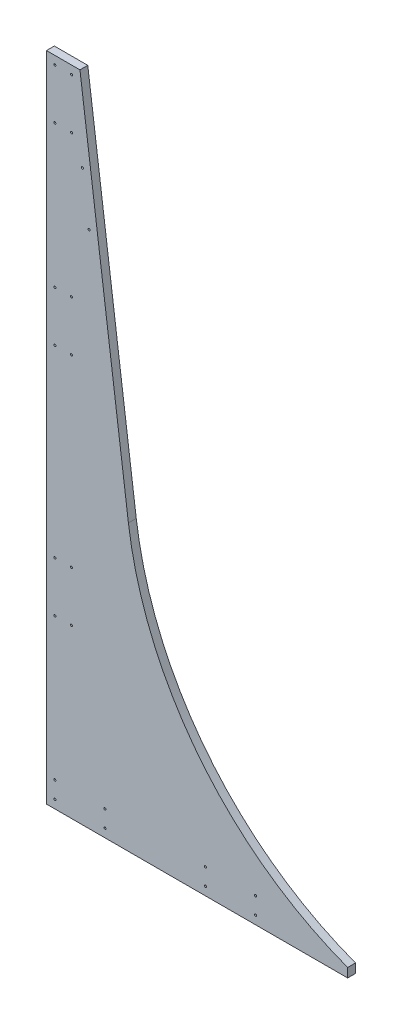
ISO-10303-21;
HEADER;
FILE_DESCRIPTION(('STEP AP214'),'2;1');
FILE_NAME('part.step','',(''),(''),'','','');
FILE_SCHEMA(('AUTOMOTIVE_DESIGN { 1 0 10303 214 1 1 1 1 }'));
ENDSEC;
DATA;
#1=APPLICATION_CONTEXT('core data for automotive mechanical design processes');
#2=APPLICATION_PROTOCOL_DEFINITION('international standard','automotive_design',2000,#1);
#3=PRODUCT_CONTEXT('',#1,'mechanical');
#4=PRODUCT('Part','Part','',(#3));
#5=PRODUCT_RELATED_PRODUCT_CATEGORY('part','',(#4));
#6=PRODUCT_DEFINITION_FORMATION('','',#4);
#7=PRODUCT_DEFINITION_CONTEXT('part definition',#1,'design');
#8=PRODUCT_DEFINITION('design','',#6,#7);
#9=PRODUCT_DEFINITION_SHAPE('','',#8);
#10=(LENGTH_UNIT() NAMED_UNIT(*) SI_UNIT(.MILLI.,.METRE.));
#11=(NAMED_UNIT(*) PLANE_ANGLE_UNIT() SI_UNIT($,.RADIAN.));
#12=(NAMED_UNIT(*) SI_UNIT($,.STERADIAN.) SOLID_ANGLE_UNIT());
#13=UNCERTAINTY_MEASURE_WITH_UNIT(LENGTH_MEASURE(1.E-05),#10,'distance_accuracy_value','');
#14=(GEOMETRIC_REPRESENTATION_CONTEXT(3) GLOBAL_UNCERTAINTY_ASSIGNED_CONTEXT((#13)) GLOBAL_UNIT_ASSIGNED_CONTEXT((#10,
#11,#12)) REPRESENTATION_CONTEXT('',''));
#15=CARTESIAN_POINT('',(0.,0.,0.));
#16=DIRECTION('',(0.,0.,1.));
#17=DIRECTION('',(1.,0.,0.));
#18=AXIS2_PLACEMENT_3D('',#15,#16,#17);
#19=CARTESIAN_POINT('',(638.116559349375,499.436357901165,11.90625));
#20=DIRECTION('',(0.,0.,-1.));
#21=DIRECTION('',(-1.,0.,0.));
#22=AXIS2_PLACEMENT_3D('',#19,#20,#21);
#23=CYLINDRICAL_SURFACE('',#22,518.182264806593);
#24=CARTESIAN_POINT('',(638.116559349375,499.436357901165,0.));
#25=DIRECTION('',(0.,0.,1.));
#26=DIRECTION('',(1.,0.,0.));
#27=AXIS2_PLACEMENT_3D('',#24,#25,#26);
#28=CIRCLE('',#27,518.182264806593);
#29=CARTESIAN_POINT('',(124.367415651835,431.8,0.));
#30=VERTEX_POINT('',#29);
#31=CARTESIAN_POINT('',(457.201,13.8620382080899,0.));
#32=VERTEX_POINT('',#31);
#33=EDGE_CURVE('E144',#30,#32,#28,.T.);
#34=ORIENTED_EDGE('',*,*,#33,.F.);
#35=DIRECTION('',(0.,0.,-1.));
#36=VECTOR('',#35,1.);
#37=CARTESIAN_POINT('',(124.367415651835,431.8,11.90625));
#38=LINE('',#37,#36);
#39=CARTESIAN_POINT('',(124.367415651835,431.8,11.90625));
#40=VERTEX_POINT('',#39);
#41=EDGE_CURVE('E13',#40,#30,#38,.T.);
#42=ORIENTED_EDGE('',*,*,#41,.F.);
#43=CARTESIAN_POINT('',(638.116559349375,499.436357901165,11.90625));
#44=DIRECTION('',(0.,0.,1.));
#45=DIRECTION('',(1.,0.,0.));
#46=AXIS2_PLACEMENT_3D('',#43,#44,#45);
#47=CIRCLE('',#46,518.182264806593);
#48=CARTESIAN_POINT('',(457.201,13.8620382080899,11.90625));
#49=VERTEX_POINT('',#48);
#50=EDGE_CURVE('E165',#40,#49,#47,.T.);
#51=ORIENTED_EDGE('',*,*,#50,.T.);
#52=DIRECTION('',(0.,0.,-1.));
#53=VECTOR('',#52,1.);
#54=CARTESIAN_POINT('',(457.201,13.8620382080899,11.90625));
#55=LINE('',#54,#53);
#56=EDGE_CURVE('E72',#49,#32,#55,.T.);
#57=ORIENTED_EDGE('',*,*,#56,.T.);
#58=EDGE_LOOP('',(#34,#42,#51,#57));
#59=FACE_BOUND('',#58,.T.);
#60=ADVANCED_FACE('F55',(#59),#23,.F.);
#61=CARTESIAN_POINT('',(178.127589027018,23.4509419846275,11.90625));
#62=DIRECTION('',(0.991444861373811,0.130526192220048,0.));
#63=DIRECTION('',(-0.130526192220048,0.991444861373811,0.));
#64=AXIS2_PLACEMENT_3D('',#61,#62,#63);
#65=PLANE('',#64);
#66=DIRECTION('',(0.130526192220048,-0.991444861373811,0.));
#67=VECTOR('',#66,1.);
#68=CARTESIAN_POINT('',(178.127589027018,23.4509419846275,0.));
#69=LINE('',#68,#67);
#70=CARTESIAN_POINT('',(50.8,990.6,0.));
#71=VERTEX_POINT('',#70);
#72=EDGE_CURVE('E147',#71,#30,#69,.T.);
#73=ORIENTED_EDGE('',*,*,#72,.F.);
#74=DIRECTION('',(0.,0.,-1.));
#75=VECTOR('',#74,1.);
#76=CARTESIAN_POINT('',(50.8,990.6,11.90625));
#77=LINE('',#76,#75);
#78=CARTESIAN_POINT('',(50.8,990.6,11.90625));
#79=VERTEX_POINT('',#78);
#80=EDGE_CURVE('E64',#79,#71,#77,.T.);
#81=ORIENTED_EDGE('',*,*,#80,.F.);
#82=DIRECTION('',(0.130526192220048,-0.991444861373811,0.));
#83=VECTOR('',#82,1.);
#84=CARTESIAN_POINT('',(178.127589027018,23.4509419846275,11.90625));
#85=LINE('',#84,#83);
#86=EDGE_CURVE('E138',#79,#40,#85,.T.);
#87=ORIENTED_EDGE('',*,*,#86,.T.);
#88=ORIENTED_EDGE('',*,*,#41,.T.);
#89=EDGE_LOOP('',(#73,#81,#87,#88));
#90=FACE_BOUND('',#89,.T.);
#91=ADVANCED_FACE('F178',(#90),#65,.T.);
#92=CARTESIAN_POINT('',(0.,990.6,11.90625));
#93=DIRECTION('',(0.,1.,0.));
#94=DIRECTION('',(0.,0.,1.));
#95=AXIS2_PLACEMENT_3D('',#92,#93,#94);
#96=PLANE('',#95);
#97=DIRECTION('',(1.,0.,0.));
#98=VECTOR('',#97,1.);
#99=CARTESIAN_POINT('',(0.,990.6,0.));
#100=LINE('',#99,#98);
#101=CARTESIAN_POINT('',(0.,990.6,0.));
#102=VERTEX_POINT('',#101);
#103=EDGE_CURVE('E152',#102,#71,#100,.T.);
#104=ORIENTED_EDGE('',*,*,#103,.F.);
#105=DIRECTION('',(0.,0.,-1.));
#106=VECTOR('',#105,1.);
#107=CARTESIAN_POINT('',(0.,990.6,11.90625));
#108=LINE('',#107,#106);
#109=CARTESIAN_POINT('',(0.,990.6,11.90625));
#110=VERTEX_POINT('',#109);
#111=EDGE_CURVE('E121',#110,#102,#108,.T.);
#112=ORIENTED_EDGE('',*,*,#111,.F.);
#113=DIRECTION('',(1.,0.,0.));
#114=VECTOR('',#113,1.);
#115=CARTESIAN_POINT('',(0.,990.6,11.90625));
#116=LINE('',#115,#114);
#117=EDGE_CURVE('E134',#110,#79,#116,.T.);
#118=ORIENTED_EDGE('',*,*,#117,.T.);
#119=ORIENTED_EDGE('',*,*,#80,.T.);
#120=EDGE_LOOP('',(#104,#112,#118,#119));
#121=FACE_BOUND('',#120,.T.);
#122=ADVANCED_FACE('F175',(#121),#96,.T.);
#123=CARTESIAN_POINT('',(0.,0.,11.90625));
#124=DIRECTION('',(-1.,0.,0.));
#125=DIRECTION('',(0.,0.,1.));
#126=AXIS2_PLACEMENT_3D('',#123,#124,#125);
#127=PLANE('',#126);
#128=DIRECTION('',(0.,1.,0.));
#129=VECTOR('',#128,1.);
#130=CARTESIAN_POINT('',(0.,0.,0.));
#131=LINE('',#130,#129);
#132=CARTESIAN_POINT('',(0.,0.,0.));
#133=VERTEX_POINT('',#132);
#134=EDGE_CURVE('E117',#133,#102,#131,.T.);
#135=ORIENTED_EDGE('',*,*,#134,.F.);
#136=DIRECTION('',(0.,0.,-1.));
#137=VECTOR('',#136,1.);
#138=CARTESIAN_POINT('',(0.,0.,11.90625));
#139=LINE('',#138,#137);
#140=CARTESIAN_POINT('',(0.,0.,11.90625));
#141=VERTEX_POINT('',#140);
#142=EDGE_CURVE('E111',#141,#133,#139,.T.);
#143=ORIENTED_EDGE('',*,*,#142,.F.);
#144=DIRECTION('',(0.,1.,0.));
#145=VECTOR('',#144,1.);
#146=CARTESIAN_POINT('',(0.,0.,11.90625));
#147=LINE('',#146,#145);
#148=EDGE_CURVE('E115',#141,#110,#147,.T.);
#149=ORIENTED_EDGE('',*,*,#148,.T.);
#150=ORIENTED_EDGE('',*,*,#111,.T.);
#151=EDGE_LOOP('',(#135,#143,#149,#150));
#152=FACE_BOUND('',#151,.T.);
#153=ADVANCED_FACE('F113',(#152),#127,.T.);
#154=CARTESIAN_POINT('',(0.,0.,11.90625));
#155=DIRECTION('',(0.,1.,0.));
#156=DIRECTION('',(0.,0.,1.));
#157=AXIS2_PLACEMENT_3D('',#154,#155,#156);
#158=PLANE('',#157);
#159=DIRECTION('',(1.,0.,0.));
#160=VECTOR('',#159,1.);
#161=CARTESIAN_POINT('',(0.,0.,0.));
#162=LINE('',#161,#160);
#163=CARTESIAN_POINT('',(457.201,0.,0.));
#164=VERTEX_POINT('',#163);
#165=EDGE_CURVE('E158',#133,#164,#162,.T.);
#166=ORIENTED_EDGE('',*,*,#165,.T.);
#167=DIRECTION('',(0.,0.,-1.));
#168=VECTOR('',#167,1.);
#169=CARTESIAN_POINT('',(457.201,0.,11.90625));
#170=LINE('',#169,#168);
#171=CARTESIAN_POINT('',(457.201,0.,11.90625));
#172=VERTEX_POINT('',#171);
#173=EDGE_CURVE('E92',#172,#164,#170,.T.);
#174=ORIENTED_EDGE('',*,*,#173,.F.);
#175=DIRECTION('',(1.,0.,0.));
#176=VECTOR('',#175,1.);
#177=CARTESIAN_POINT('',(0.,0.,11.90625));
#178=LINE('',#177,#176);
#179=EDGE_CURVE('E123',#141,#172,#178,.T.);
#180=ORIENTED_EDGE('',*,*,#179,.F.);
#181=ORIENTED_EDGE('',*,*,#142,.T.);
#182=EDGE_LOOP('',(#166,#174,#180,#181));
#183=FACE_BOUND('',#182,.T.);
#184=ADVANCED_FACE('F124',(#183),#158,.F.);
#185=CARTESIAN_POINT('',(457.201,0.,11.90625));
#186=DIRECTION('',(1.,0.,0.));
#187=DIRECTION('',(0.,0.,-1.));
#188=AXIS2_PLACEMENT_3D('',#185,#186,#187);
#189=PLANE('',#188);
#190=DIRECTION('',(0.,-1.,0.));
#191=VECTOR('',#190,1.);
#192=CARTESIAN_POINT('',(457.201,0.,0.));
#193=LINE('',#192,#191);
#194=EDGE_CURVE('E161',#32,#164,#193,.T.);
#195=ORIENTED_EDGE('',*,*,#194,.F.);
#196=ORIENTED_EDGE('',*,*,#56,.F.);
#197=DIRECTION('',(0.,-1.,0.));
#198=VECTOR('',#197,1.);
#199=CARTESIAN_POINT('',(457.201,0.,11.90625));
#200=LINE('',#199,#198);
#201=EDGE_CURVE('E128',#49,#172,#200,.T.);
#202=ORIENTED_EDGE('',*,*,#201,.T.);
#203=ORIENTED_EDGE('',*,*,#173,.T.);
#204=EDGE_LOOP('',(#195,#196,#202,#203));
#205=FACE_BOUND('',#204,.T.);
#206=ADVANCED_FACE('F181',(#205),#189,.T.);
#207=CARTESIAN_POINT('',(0.,0.,11.90625));
#208=DIRECTION('',(0.,0.,1.));
#209=DIRECTION('',(1.,0.,0.));
#210=AXIS2_PLACEMENT_3D('',#207,#208,#209);
#211=PLANE('',#210);
#212=CARTESIAN_POINT('',(64.7421997103902,787.4,11.90625));
#213=DIRECTION('',(0.,0.,1.));
#214=DIRECTION('',(1.,0.,0.));
#215=AXIS2_PLACEMENT_3D('',#212,#213,#214);
#216=CIRCLE('',#215,1.58750000000007);
#217=CARTESIAN_POINT('',(66.3296997103903,787.4,11.90625));
#218=VERTEX_POINT('',#217);
#219=EDGE_CURVE('E458',#218,#218,#216,.T.);
#220=ORIENTED_EDGE('',*,*,#219,.F.);
#221=EDGE_LOOP('',(#220));
#222=FACE_BOUND('',#221,.T.);
#223=CARTESIAN_POINT('',(54.7102793942309,863.6,11.90625));
#224=DIRECTION('',(0.,0.,1.));
#225=DIRECTION('',(1.,0.,0.));
#226=AXIS2_PLACEMENT_3D('',#223,#224,#225);
#227=CIRCLE('',#226,1.58750000000009);
#228=CARTESIAN_POINT('',(56.297779394231,863.6,11.90625));
#229=VERTEX_POINT('',#228);
#230=EDGE_CURVE('E467',#229,#229,#227,.T.);
#231=ORIENTED_EDGE('',*,*,#230,.F.);
#232=EDGE_LOOP('',(#231));
#233=FACE_BOUND('',#232,.T.);
#234=CARTESIAN_POINT('',(12.7000000000001,38.0999999999999,11.90625));
#235=DIRECTION('',(0.,0.,1.));
#236=DIRECTION('',(1.,0.,0.));
#237=AXIS2_PLACEMENT_3D('',#234,#235,#236);
#238=CIRCLE('',#237,1.5875);
#239=CARTESIAN_POINT('',(14.2875000000001,38.0999999999999,11.90625));
#240=VERTEX_POINT('',#239);
#241=EDGE_CURVE('E517',#240,#240,#238,.T.);
#242=ORIENTED_EDGE('',*,*,#241,.F.);
#243=EDGE_LOOP('',(#242));
#244=FACE_BOUND('',#243,.T.);
#245=CARTESIAN_POINT('',(38.1000000000001,330.2,11.90625));
#246=DIRECTION('',(0.,0.,1.));
#247=DIRECTION('',(1.,0.,0.));
#248=AXIS2_PLACEMENT_3D('',#245,#246,#247);
#249=CIRCLE('',#248,1.58750000000001);
#250=CARTESIAN_POINT('',(39.6875000000001,330.2,11.90625));
#251=VERTEX_POINT('',#250);
#252=EDGE_CURVE('E534',#251,#251,#249,.T.);
#253=ORIENTED_EDGE('',*,*,#252,.F.);
#254=EDGE_LOOP('',(#253));
#255=FACE_BOUND('',#254,.T.);
#256=CARTESIAN_POINT('',(12.7000000000001,330.2,11.90625));
#257=DIRECTION('',(0.,0.,1.));
#258=DIRECTION('',(1.,0.,0.));
#259=AXIS2_PLACEMENT_3D('',#256,#257,#258);
#260=CIRCLE('',#259,1.5875);
#261=CARTESIAN_POINT('',(14.2875000000001,330.2,11.90625));
#262=VERTEX_POINT('',#261);
#263=EDGE_CURVE('E533',#262,#262,#260,.T.);
#264=ORIENTED_EDGE('',*,*,#263,.F.);
#265=EDGE_LOOP('',(#264));
#266=FACE_BOUND('',#265,.T.);
#267=CARTESIAN_POINT('',(38.1000000000001,254.,11.90625));
#268=DIRECTION('',(0.,0.,1.));
#269=DIRECTION('',(1.,0.,0.));
#270=AXIS2_PLACEMENT_3D('',#267,#268,#269);
#271=CIRCLE('',#270,1.58750000000006);
#272=CARTESIAN_POINT('',(39.6875000000001,254.,11.90625));
#273=VERTEX_POINT('',#272);
#274=EDGE_CURVE('E550',#273,#273,#271,.T.);
#275=ORIENTED_EDGE('',*,*,#274,.F.);
#276=EDGE_LOOP('',(#275));
#277=FACE_BOUND('',#276,.T.);
#278=CARTESIAN_POINT('',(241.3,38.0999999999999,11.90625));
#279=DIRECTION('',(0.,0.,1.));
#280=DIRECTION('',(1.,0.,0.));
#281=AXIS2_PLACEMENT_3D('',#278,#279,#280);
#282=CIRCLE('',#281,1.58749999999999);
#283=CARTESIAN_POINT('',(242.8875,38.0999999999999,11.90625));
#284=VERTEX_POINT('',#283);
#285=EDGE_CURVE('E485',#284,#284,#282,.T.);
#286=ORIENTED_EDGE('',*,*,#285,.F.);
#287=EDGE_LOOP('',(#286));
#288=FACE_BOUND('',#287,.T.);
#289=CARTESIAN_POINT('',(88.9000000000001,12.6999999999999,11.90625));
#290=DIRECTION('',(0.,0.,1.));
#291=DIRECTION('',(1.,0.,0.));
#292=AXIS2_PLACEMENT_3D('',#289,#290,#291);
#293=CIRCLE('',#292,1.58749999999998);
#294=CARTESIAN_POINT('',(90.4875000000001,12.6999999999999,11.90625));
#295=VERTEX_POINT('',#294);
#296=EDGE_CURVE('E502',#295,#295,#293,.T.);
#297=ORIENTED_EDGE('',*,*,#296,.F.);
#298=EDGE_LOOP('',(#297));
#299=FACE_BOUND('',#298,.T.);
#300=CARTESIAN_POINT('',(88.9000000000001,38.0999999999999,11.90625));
#301=DIRECTION('',(0.,0.,1.));
#302=DIRECTION('',(1.,0.,0.));
#303=AXIS2_PLACEMENT_3D('',#300,#301,#302);
#304=CIRCLE('',#303,1.58749999999999);
#305=CARTESIAN_POINT('',(90.4875000000001,38.0999999999999,11.90625));
#306=VERTEX_POINT('',#305);
#307=EDGE_CURVE('E501',#306,#306,#304,.T.);
#308=ORIENTED_EDGE('',*,*,#307,.F.);
#309=EDGE_LOOP('',(#308));
#310=FACE_BOUND('',#309,.T.);
#311=CARTESIAN_POINT('',(12.7000000000001,12.6999999999999,11.90625));
#312=DIRECTION('',(0.,0.,1.));
#313=DIRECTION('',(1.,0.,0.));
#314=AXIS2_PLACEMENT_3D('',#311,#312,#313);
#315=CIRCLE('',#314,1.5875);
#316=CARTESIAN_POINT('',(14.2875000000001,12.6999999999999,11.90625));
#317=VERTEX_POINT('',#316);
#318=EDGE_CURVE('E518',#317,#317,#315,.T.);
#319=ORIENTED_EDGE('',*,*,#318,.F.);
#320=EDGE_LOOP('',(#319));
#321=FACE_BOUND('',#320,.T.);
#322=CARTESIAN_POINT('',(12.7,609.6,11.90625));
#323=DIRECTION('',(0.,0.,1.));
#324=DIRECTION('',(1.,0.,0.));
#325=AXIS2_PLACEMENT_3D('',#322,#323,#324);
#326=CIRCLE('',#325,1.58750000000007);
#327=CARTESIAN_POINT('',(14.2875000000001,609.6,11.90625));
#328=VERTEX_POINT('',#327);
#329=EDGE_CURVE('E581',#328,#328,#326,.T.);
#330=ORIENTED_EDGE('',*,*,#329,.F.);
#331=EDGE_LOOP('',(#330));
#332=FACE_BOUND('',#331,.T.);
#333=CARTESIAN_POINT('',(38.1,901.7,11.90625));
#334=DIRECTION('',(0.,0.,1.));
#335=DIRECTION('',(1.,0.,0.));
#336=AXIS2_PLACEMENT_3D('',#333,#334,#335);
#337=CIRCLE('',#336,1.58750000000008);
#338=CARTESIAN_POINT('',(39.6875000000001,901.7,11.90625));
#339=VERTEX_POINT('',#338);
#340=EDGE_CURVE('E598',#339,#339,#337,.T.);
#341=ORIENTED_EDGE('',*,*,#340,.F.);
#342=EDGE_LOOP('',(#341));
#343=FACE_BOUND('',#342,.T.);
#344=CARTESIAN_POINT('',(12.7,901.7,11.90625));
#345=DIRECTION('',(0.,0.,1.));
#346=DIRECTION('',(1.,0.,0.));
#347=AXIS2_PLACEMENT_3D('',#344,#345,#346);
#348=CIRCLE('',#347,1.58750000000007);
#349=CARTESIAN_POINT('',(14.2875000000001,901.7,11.90625));
#350=VERTEX_POINT('',#349);
#351=EDGE_CURVE('E597',#350,#350,#348,.T.);
#352=ORIENTED_EDGE('',*,*,#351,.F.);
#353=EDGE_LOOP('',(#352));
#354=FACE_BOUND('',#353,.T.);
#355=CARTESIAN_POINT('',(38.1,977.9,11.90625));
#356=DIRECTION('',(0.,0.,1.));
#357=DIRECTION('',(1.,0.,0.));
#358=AXIS2_PLACEMENT_3D('',#355,#356,#357);
#359=CIRCLE('',#358,1.58750000000007);
#360=CARTESIAN_POINT('',(39.6875000000001,977.9,11.90625));
#361=VERTEX_POINT('',#360);
#362=EDGE_CURVE('E614',#361,#361,#359,.T.);
#363=ORIENTED_EDGE('',*,*,#362,.F.);
#364=EDGE_LOOP('',(#363));
#365=FACE_BOUND('',#364,.T.);
#366=CARTESIAN_POINT('',(12.7000000000001,254.,11.90625));
#367=DIRECTION('',(0.,0.,1.));
#368=DIRECTION('',(1.,0.,0.));
#369=AXIS2_PLACEMENT_3D('',#366,#367,#368);
#370=CIRCLE('',#369,1.58750000000002);
#371=CARTESIAN_POINT('',(14.2875000000001,254.,11.90625));
#372=VERTEX_POINT('',#371);
#373=EDGE_CURVE('E549',#372,#372,#370,.T.);
#374=ORIENTED_EDGE('',*,*,#373,.F.);
#375=EDGE_LOOP('',(#374));
#376=FACE_BOUND('',#375,.T.);
#377=CARTESIAN_POINT('',(38.1,685.8,11.90625));
#378=DIRECTION('',(0.,0.,1.));
#379=DIRECTION('',(1.,0.,0.));
#380=AXIS2_PLACEMENT_3D('',#377,#378,#379);
#381=CIRCLE('',#380,1.58750000000007);
#382=CARTESIAN_POINT('',(39.6875000000001,685.8,11.90625));
#383=VERTEX_POINT('',#382);
#384=EDGE_CURVE('E566',#383,#383,#381,.T.);
#385=ORIENTED_EDGE('',*,*,#384,.F.);
#386=EDGE_LOOP('',(#385));
#387=FACE_BOUND('',#386,.T.);
#388=CARTESIAN_POINT('',(12.7,685.8,11.90625));
#389=DIRECTION('',(0.,0.,1.));
#390=DIRECTION('',(1.,0.,0.));
#391=AXIS2_PLACEMENT_3D('',#388,#389,#390);
#392=CIRCLE('',#391,1.58750000000004);
#393=CARTESIAN_POINT('',(14.2875000000001,685.8,11.90625));
#394=VERTEX_POINT('',#393);
#395=EDGE_CURVE('E565',#394,#394,#392,.T.);
#396=ORIENTED_EDGE('',*,*,#395,.F.);
#397=EDGE_LOOP('',(#396));
#398=FACE_BOUND('',#397,.T.);
#399=CARTESIAN_POINT('',(38.1000000000001,609.6,11.90625));
#400=DIRECTION('',(0.,0.,1.));
#401=DIRECTION('',(1.,0.,0.));
#402=AXIS2_PLACEMENT_3D('',#399,#400,#401);
#403=CIRCLE('',#402,1.58750000000007);
#404=CARTESIAN_POINT('',(39.6875000000001,609.6,11.90625));
#405=VERTEX_POINT('',#404);
#406=EDGE_CURVE('E582',#405,#405,#403,.T.);
#407=ORIENTED_EDGE('',*,*,#406,.F.);
#408=EDGE_LOOP('',(#407));
#409=FACE_BOUND('',#408,.T.);
#410=CARTESIAN_POINT('',(317.5,12.6999999999999,11.90625));
#411=DIRECTION('',(0.,0.,1.));
#412=DIRECTION('',(1.,0.,0.));
#413=AXIS2_PLACEMENT_3D('',#410,#411,#412);
#414=CIRCLE('',#413,1.58750000000004);
#415=CARTESIAN_POINT('',(319.0875,12.6999999999999,11.90625));
#416=VERTEX_POINT('',#415);
#417=EDGE_CURVE('E464',#416,#416,#414,.T.);
#418=ORIENTED_EDGE('',*,*,#417,.F.);
#419=EDGE_LOOP('',(#418));
#420=FACE_BOUND('',#419,.T.);
#421=CARTESIAN_POINT('',(241.3,12.6999999999999,11.90625));
#422=DIRECTION('',(0.,0.,1.));
#423=DIRECTION('',(1.,0.,0.));
#424=AXIS2_PLACEMENT_3D('',#421,#422,#423);
#425=CIRCLE('',#424,1.58749999999999);
#426=CARTESIAN_POINT('',(242.8875,12.6999999999999,11.90625));
#427=VERTEX_POINT('',#426);
#428=EDGE_CURVE('E477',#427,#427,#425,.T.);
#429=ORIENTED_EDGE('',*,*,#428,.F.);
#430=EDGE_LOOP('',(#429));
#431=FACE_BOUND('',#430,.T.);
#432=CARTESIAN_POINT('',(317.5,38.0999999999999,11.90625));
#433=DIRECTION('',(0.,0.,1.));
#434=DIRECTION('',(1.,0.,0.));
#435=AXIS2_PLACEMENT_3D('',#432,#433,#434);
#436=CIRCLE('',#435,1.58750000000004);
#437=CARTESIAN_POINT('',(319.0875,38.0999999999999,11.90625));
#438=VERTEX_POINT('',#437);
#439=EDGE_CURVE('E486',#438,#438,#436,.T.);
#440=ORIENTED_EDGE('',*,*,#439,.F.);
#441=EDGE_LOOP('',(#440));
#442=FACE_BOUND('',#441,.T.);
#443=CARTESIAN_POINT('',(12.7,977.9,11.90625));
#444=DIRECTION('',(0.,0.,1.));
#445=DIRECTION('',(1.,0.,0.));
#446=AXIS2_PLACEMENT_3D('',#443,#444,#445);
#447=CIRCLE('',#446,1.58750000000004);
#448=CARTESIAN_POINT('',(14.2875,977.9,11.90625));
#449=VERTEX_POINT('',#448);
#450=EDGE_CURVE('E613',#449,#449,#447,.T.);
#451=ORIENTED_EDGE('',*,*,#450,.F.);
#452=EDGE_LOOP('',(#451));
#453=FACE_BOUND('',#452,.T.);
#454=ORIENTED_EDGE('',*,*,#50,.F.);
#455=ORIENTED_EDGE('',*,*,#86,.F.);
#456=ORIENTED_EDGE('',*,*,#117,.F.);
#457=ORIENTED_EDGE('',*,*,#148,.F.);
#458=ORIENTED_EDGE('',*,*,#179,.T.);
#459=ORIENTED_EDGE('',*,*,#201,.F.);
#460=EDGE_LOOP('',(#454,#455,#456,#457,#458,#459));
#461=FACE_BOUND('',#460,.T.);
#462=ADVANCED_FACE('F131',(#222,#233,#244,#255,#266,#277,#288,#299,#310,#321,#332,#343,#354,
#365,#376,#387,#398,#409,#420,#431,#442,#453,#461),#211,.T.);
#463=CARTESIAN_POINT('',(0.,0.,0.));
#464=DIRECTION('',(0.,0.,1.));
#465=DIRECTION('',(1.,0.,0.));
#466=AXIS2_PLACEMENT_3D('',#463,#464,#465);
#467=PLANE('',#466);
#468=CARTESIAN_POINT('',(64.7421997103902,787.4,0.));
#469=DIRECTION('',(0.,0.,1.));
#470=DIRECTION('',(1.,0.,0.));
#471=AXIS2_PLACEMENT_3D('',#468,#469,#470);
#472=CIRCLE('',#471,1.58750000000007);
#473=CARTESIAN_POINT('',(66.3296997103903,787.4,0.));
#474=VERTEX_POINT('',#473);
#475=EDGE_CURVE('E455',#474,#474,#472,.T.);
#476=ORIENTED_EDGE('',*,*,#475,.T.);
#477=EDGE_LOOP('',(#476));
#478=FACE_BOUND('',#477,.T.);
#479=CARTESIAN_POINT('',(54.7102793942309,863.6,0.));
#480=DIRECTION('',(0.,0.,1.));
#481=DIRECTION('',(1.,0.,0.));
#482=AXIS2_PLACEMENT_3D('',#479,#480,#481);
#483=CIRCLE('',#482,1.58750000000009);
#484=CARTESIAN_POINT('',(56.297779394231,863.6,0.));
#485=VERTEX_POINT('',#484);
#486=EDGE_CURVE('E460',#485,#485,#483,.T.);
#487=ORIENTED_EDGE('',*,*,#486,.T.);
#488=EDGE_LOOP('',(#487));
#489=FACE_BOUND('',#488,.T.);
#490=CARTESIAN_POINT('',(12.7000000000001,38.0999999999999,0.));
#491=DIRECTION('',(0.,0.,1.));
#492=DIRECTION('',(1.,0.,0.));
#493=AXIS2_PLACEMENT_3D('',#490,#491,#492);
#494=CIRCLE('',#493,1.5875);
#495=CARTESIAN_POINT('',(14.2875000000001,38.0999999999999,0.));
#496=VERTEX_POINT('',#495);
#497=EDGE_CURVE('E538',#496,#496,#494,.T.);
#498=ORIENTED_EDGE('',*,*,#497,.T.);
#499=EDGE_LOOP('',(#498));
#500=FACE_BOUND('',#499,.T.);
#501=CARTESIAN_POINT('',(38.1000000000001,330.2,0.));
#502=DIRECTION('',(0.,0.,1.));
#503=DIRECTION('',(1.,0.,0.));
#504=AXIS2_PLACEMENT_3D('',#501,#502,#503);
#505=CIRCLE('',#504,1.58750000000001);
#506=CARTESIAN_POINT('',(39.6875000000001,330.2,0.));
#507=VERTEX_POINT('',#506);
#508=EDGE_CURVE('E529',#507,#507,#505,.T.);
#509=ORIENTED_EDGE('',*,*,#508,.T.);
#510=EDGE_LOOP('',(#509));
#511=FACE_BOUND('',#510,.T.);
#512=CARTESIAN_POINT('',(12.7000000000001,330.2,0.));
#513=DIRECTION('',(0.,0.,1.));
#514=DIRECTION('',(1.,0.,0.));
#515=AXIS2_PLACEMENT_3D('',#512,#513,#514);
#516=CIRCLE('',#515,1.5875);
#517=CARTESIAN_POINT('',(14.2875000000001,330.2,0.));
#518=VERTEX_POINT('',#517);
#519=EDGE_CURVE('E554',#518,#518,#516,.T.);
#520=ORIENTED_EDGE('',*,*,#519,.T.);
#521=EDGE_LOOP('',(#520));
#522=FACE_BOUND('',#521,.T.);
#523=CARTESIAN_POINT('',(38.1000000000001,254.,0.));
#524=DIRECTION('',(0.,0.,1.));
#525=DIRECTION('',(1.,0.,0.));
#526=AXIS2_PLACEMENT_3D('',#523,#524,#525);
#527=CIRCLE('',#526,1.58750000000006);
#528=CARTESIAN_POINT('',(39.6875000000001,254.,0.));
#529=VERTEX_POINT('',#528);
#530=EDGE_CURVE('E545',#529,#529,#527,.T.);
#531=ORIENTED_EDGE('',*,*,#530,.T.);
#532=EDGE_LOOP('',(#531));
#533=FACE_BOUND('',#532,.T.);
#534=CARTESIAN_POINT('',(241.3,38.0999999999999,0.));
#535=DIRECTION('',(0.,0.,1.));
#536=DIRECTION('',(1.,0.,0.));
#537=AXIS2_PLACEMENT_3D('',#534,#535,#536);
#538=CIRCLE('',#537,1.58749999999999);
#539=CARTESIAN_POINT('',(242.8875,38.0999999999999,0.));
#540=VERTEX_POINT('',#539);
#541=EDGE_CURVE('E506',#540,#540,#538,.T.);
#542=ORIENTED_EDGE('',*,*,#541,.T.);
#543=EDGE_LOOP('',(#542));
#544=FACE_BOUND('',#543,.T.);
#545=CARTESIAN_POINT('',(88.9000000000001,12.6999999999999,0.));
#546=DIRECTION('',(0.,0.,1.));
#547=DIRECTION('',(1.,0.,0.));
#548=AXIS2_PLACEMENT_3D('',#545,#546,#547);
#549=CIRCLE('',#548,1.58749999999998);
#550=CARTESIAN_POINT('',(90.4875000000001,12.6999999999999,0.));
#551=VERTEX_POINT('',#550);
#552=EDGE_CURVE('E497',#551,#551,#549,.T.);
#553=ORIENTED_EDGE('',*,*,#552,.T.);
#554=EDGE_LOOP('',(#553));
#555=FACE_BOUND('',#554,.T.);
#556=CARTESIAN_POINT('',(88.9000000000001,38.0999999999999,0.));
#557=DIRECTION('',(0.,0.,1.));
#558=DIRECTION('',(1.,0.,0.));
#559=AXIS2_PLACEMENT_3D('',#556,#557,#558);
#560=CIRCLE('',#559,1.58749999999999);
#561=CARTESIAN_POINT('',(90.4875000000001,38.0999999999999,0.));
#562=VERTEX_POINT('',#561);
#563=EDGE_CURVE('E522',#562,#562,#560,.T.);
#564=ORIENTED_EDGE('',*,*,#563,.T.);
#565=EDGE_LOOP('',(#564));
#566=FACE_BOUND('',#565,.T.);
#567=CARTESIAN_POINT('',(12.7000000000001,12.6999999999999,0.));
#568=DIRECTION('',(0.,0.,1.));
#569=DIRECTION('',(1.,0.,0.));
#570=AXIS2_PLACEMENT_3D('',#567,#568,#569);
#571=CIRCLE('',#570,1.5875);
#572=CARTESIAN_POINT('',(14.2875000000001,12.6999999999999,0.));
#573=VERTEX_POINT('',#572);
#574=EDGE_CURVE('E513',#573,#573,#571,.T.);
#575=ORIENTED_EDGE('',*,*,#574,.T.);
#576=EDGE_LOOP('',(#575));
#577=FACE_BOUND('',#576,.T.);
#578=CARTESIAN_POINT('',(12.7,609.6,0.));
#579=DIRECTION('',(0.,0.,1.));
#580=DIRECTION('',(1.,0.,0.));
#581=AXIS2_PLACEMENT_3D('',#578,#579,#580);
#582=CIRCLE('',#581,1.58750000000007);
#583=CARTESIAN_POINT('',(14.2875000000001,609.6,0.));
#584=VERTEX_POINT('',#583);
#585=EDGE_CURVE('E602',#584,#584,#582,.T.);
#586=ORIENTED_EDGE('',*,*,#585,.T.);
#587=EDGE_LOOP('',(#586));
#588=FACE_BOUND('',#587,.T.);
#589=CARTESIAN_POINT('',(38.1,901.7,0.));
#590=DIRECTION('',(0.,0.,1.));
#591=DIRECTION('',(1.,0.,0.));
#592=AXIS2_PLACEMENT_3D('',#589,#590,#591);
#593=CIRCLE('',#592,1.58750000000008);
#594=CARTESIAN_POINT('',(39.6875000000001,901.7,0.));
#595=VERTEX_POINT('',#594);
#596=EDGE_CURVE('E593',#595,#595,#593,.T.);
#597=ORIENTED_EDGE('',*,*,#596,.T.);
#598=EDGE_LOOP('',(#597));
#599=FACE_BOUND('',#598,.T.);
#600=CARTESIAN_POINT('',(12.7,901.7,0.));
#601=DIRECTION('',(0.,0.,1.));
#602=DIRECTION('',(1.,0.,0.));
#603=AXIS2_PLACEMENT_3D('',#600,#601,#602);
#604=CIRCLE('',#603,1.58750000000007);
#605=CARTESIAN_POINT('',(14.2875000000001,901.7,0.));
#606=VERTEX_POINT('',#605);
#607=EDGE_CURVE('E618',#606,#606,#604,.T.);
#608=ORIENTED_EDGE('',*,*,#607,.T.);
#609=EDGE_LOOP('',(#608));
#610=FACE_BOUND('',#609,.T.);
#611=CARTESIAN_POINT('',(38.1,977.9,0.));
#612=DIRECTION('',(0.,0.,1.));
#613=DIRECTION('',(1.,0.,0.));
#614=AXIS2_PLACEMENT_3D('',#611,#612,#613);
#615=CIRCLE('',#614,1.58750000000007);
#616=CARTESIAN_POINT('',(39.6875000000001,977.9,0.));
#617=VERTEX_POINT('',#616);
#618=EDGE_CURVE('E609',#617,#617,#615,.T.);
#619=ORIENTED_EDGE('',*,*,#618,.T.);
#620=EDGE_LOOP('',(#619));
#621=FACE_BOUND('',#620,.T.);
#622=CARTESIAN_POINT('',(12.7000000000001,254.,0.));
#623=DIRECTION('',(0.,0.,1.));
#624=DIRECTION('',(1.,0.,0.));
#625=AXIS2_PLACEMENT_3D('',#622,#623,#624);
#626=CIRCLE('',#625,1.58750000000002);
#627=CARTESIAN_POINT('',(14.2875000000001,254.,0.));
#628=VERTEX_POINT('',#627);
#629=EDGE_CURVE('E570',#628,#628,#626,.T.);
#630=ORIENTED_EDGE('',*,*,#629,.T.);
#631=EDGE_LOOP('',(#630));
#632=FACE_BOUND('',#631,.T.);
#633=CARTESIAN_POINT('',(38.1,685.8,0.));
#634=DIRECTION('',(0.,0.,1.));
#635=DIRECTION('',(1.,0.,0.));
#636=AXIS2_PLACEMENT_3D('',#633,#634,#635);
#637=CIRCLE('',#636,1.58750000000007);
#638=CARTESIAN_POINT('',(39.6875000000001,685.8,0.));
#639=VERTEX_POINT('',#638);
#640=EDGE_CURVE('E561',#639,#639,#637,.T.);
#641=ORIENTED_EDGE('',*,*,#640,.T.);
#642=EDGE_LOOP('',(#641));
#643=FACE_BOUND('',#642,.T.);
#644=CARTESIAN_POINT('',(12.7,685.8,0.));
#645=DIRECTION('',(0.,0.,1.));
#646=DIRECTION('',(1.,0.,0.));
#647=AXIS2_PLACEMENT_3D('',#644,#645,#646);
#648=CIRCLE('',#647,1.58750000000004);
#649=CARTESIAN_POINT('',(14.2875000000001,685.8,0.));
#650=VERTEX_POINT('',#649);
#651=EDGE_CURVE('E586',#650,#650,#648,.T.);
#652=ORIENTED_EDGE('',*,*,#651,.T.);
#653=EDGE_LOOP('',(#652));
#654=FACE_BOUND('',#653,.T.);
#655=CARTESIAN_POINT('',(38.1000000000001,609.6,0.));
#656=DIRECTION('',(0.,0.,1.));
#657=DIRECTION('',(1.,0.,0.));
#658=AXIS2_PLACEMENT_3D('',#655,#656,#657);
#659=CIRCLE('',#658,1.58750000000007);
#660=CARTESIAN_POINT('',(39.6875000000001,609.6,0.));
#661=VERTEX_POINT('',#660);
#662=EDGE_CURVE('E577',#661,#661,#659,.T.);
#663=ORIENTED_EDGE('',*,*,#662,.T.);
#664=EDGE_LOOP('',(#663));
#665=FACE_BOUND('',#664,.T.);
#666=CARTESIAN_POINT('',(317.5,12.6999999999999,0.));
#667=DIRECTION('',(0.,0.,1.));
#668=DIRECTION('',(1.,0.,0.));
#669=AXIS2_PLACEMENT_3D('',#666,#667,#668);
#670=CIRCLE('',#669,1.58750000000004);
#671=CARTESIAN_POINT('',(319.0875,12.6999999999999,0.));
#672=VERTEX_POINT('',#671);
#673=EDGE_CURVE('E473',#672,#672,#670,.T.);
#674=ORIENTED_EDGE('',*,*,#673,.T.);
#675=EDGE_LOOP('',(#674));
#676=FACE_BOUND('',#675,.T.);
#677=CARTESIAN_POINT('',(241.3,12.6999999999999,0.));
#678=DIRECTION('',(0.,0.,1.));
#679=DIRECTION('',(1.,0.,0.));
#680=AXIS2_PLACEMENT_3D('',#677,#678,#679);
#681=CIRCLE('',#680,1.58749999999999);
#682=CARTESIAN_POINT('',(242.8875,12.6999999999999,0.));
#683=VERTEX_POINT('',#682);
#684=EDGE_CURVE('E490',#683,#683,#681,.T.);
#685=ORIENTED_EDGE('',*,*,#684,.T.);
#686=EDGE_LOOP('',(#685));
#687=FACE_BOUND('',#686,.T.);
#688=CARTESIAN_POINT('',(317.5,38.0999999999999,0.));
#689=DIRECTION('',(0.,0.,1.));
#690=DIRECTION('',(1.,0.,0.));
#691=AXIS2_PLACEMENT_3D('',#688,#689,#690);
#692=CIRCLE('',#691,1.58750000000004);
#693=CARTESIAN_POINT('',(319.0875,38.0999999999999,0.));
#694=VERTEX_POINT('',#693);
#695=EDGE_CURVE('E481',#694,#694,#692,.T.);
#696=ORIENTED_EDGE('',*,*,#695,.T.);
#697=EDGE_LOOP('',(#696));
#698=FACE_BOUND('',#697,.T.);
#699=CARTESIAN_POINT('',(12.7,977.9,0.));
#700=DIRECTION('',(0.,0.,1.));
#701=DIRECTION('',(1.,0.,0.));
#702=AXIS2_PLACEMENT_3D('',#699,#700,#701);
#703=CIRCLE('',#702,1.58750000000004);
#704=CARTESIAN_POINT('',(14.2875,977.9,0.));
#705=VERTEX_POINT('',#704);
#706=EDGE_CURVE('E148',#705,#705,#703,.T.);
#707=ORIENTED_EDGE('',*,*,#706,.T.);
#708=EDGE_LOOP('',(#707));
#709=FACE_BOUND('',#708,.T.);
#710=ORIENTED_EDGE('',*,*,#33,.T.);
#711=ORIENTED_EDGE('',*,*,#194,.T.);
#712=ORIENTED_EDGE('',*,*,#165,.F.);
#713=ORIENTED_EDGE('',*,*,#134,.T.);
#714=ORIENTED_EDGE('',*,*,#103,.T.);
#715=ORIENTED_EDGE('',*,*,#72,.T.);
#716=EDGE_LOOP('',(#710,#711,#712,#713,#714,#715));
#717=FACE_BOUND('',#716,.T.);
#718=ADVANCED_FACE('F180',(#478,#489,#500,#511,#522,#533,#544,#555,#566,#577,#588,#599,#610,
#621,#632,#643,#654,#665,#676,#687,#698,#709,#717),#467,.F.);
#719=CARTESIAN_POINT('',(12.7,977.9,0.));
#720=DIRECTION('',(0.,0.,1.));
#721=DIRECTION('',(1.,0.,0.));
#722=AXIS2_PLACEMENT_3D('',#719,#720,#721);
#723=CYLINDRICAL_SURFACE('',#722,1.58750000000004);
#724=ORIENTED_EDGE('',*,*,#706,.F.);
#725=EDGE_LOOP('',(#724));
#726=FACE_BOUND('',#725,.T.);
#727=ORIENTED_EDGE('',*,*,#450,.T.);
#728=EDGE_LOOP('',(#727));
#729=FACE_BOUND('',#728,.T.);
#730=ADVANCED_FACE('F220',(#726,#729),#723,.F.);
#731=CARTESIAN_POINT('',(317.5,38.0999999999999,0.));
#732=DIRECTION('',(0.,0.,1.));
#733=DIRECTION('',(1.,0.,0.));
#734=AXIS2_PLACEMENT_3D('',#731,#732,#733);
#735=CYLINDRICAL_SURFACE('',#734,1.58750000000004);
#736=ORIENTED_EDGE('',*,*,#695,.F.);
#737=EDGE_LOOP('',(#736));
#738=FACE_BOUND('',#737,.T.);
#739=ORIENTED_EDGE('',*,*,#439,.T.);
#740=EDGE_LOOP('',(#739));
#741=FACE_BOUND('',#740,.T.);
#742=ADVANCED_FACE('F225',(#738,#741),#735,.F.);
#743=CARTESIAN_POINT('',(241.3,12.6999999999999,0.));
#744=DIRECTION('',(0.,0.,1.));
#745=DIRECTION('',(1.,0.,0.));
#746=AXIS2_PLACEMENT_3D('',#743,#744,#745);
#747=CYLINDRICAL_SURFACE('',#746,1.58749999999999);
#748=ORIENTED_EDGE('',*,*,#684,.F.);
#749=EDGE_LOOP('',(#748));
#750=FACE_BOUND('',#749,.T.);
#751=ORIENTED_EDGE('',*,*,#428,.T.);
#752=EDGE_LOOP('',(#751));
#753=FACE_BOUND('',#752,.T.);
#754=ADVANCED_FACE('F237',(#750,#753),#747,.F.);
#755=CARTESIAN_POINT('',(317.5,12.6999999999999,0.));
#756=DIRECTION('',(0.,0.,1.));
#757=DIRECTION('',(1.,0.,0.));
#758=AXIS2_PLACEMENT_3D('',#755,#756,#757);
#759=CYLINDRICAL_SURFACE('',#758,1.58750000000004);
#760=ORIENTED_EDGE('',*,*,#673,.F.);
#761=EDGE_LOOP('',(#760));
#762=FACE_BOUND('',#761,.T.);
#763=ORIENTED_EDGE('',*,*,#417,.T.);
#764=EDGE_LOOP('',(#763));
#765=FACE_BOUND('',#764,.T.);
#766=ADVANCED_FACE('F247',(#762,#765),#759,.F.);
#767=CARTESIAN_POINT('',(38.1000000000001,609.6,0.));
#768=DIRECTION('',(0.,0.,1.));
#769=DIRECTION('',(1.,0.,0.));
#770=AXIS2_PLACEMENT_3D('',#767,#768,#769);
#771=CYLINDRICAL_SURFACE('',#770,1.58750000000007);
#772=ORIENTED_EDGE('',*,*,#662,.F.);
#773=EDGE_LOOP('',(#772));
#774=FACE_BOUND('',#773,.T.);
#775=ORIENTED_EDGE('',*,*,#406,.T.);
#776=EDGE_LOOP('',(#775));
#777=FACE_BOUND('',#776,.T.);
#778=ADVANCED_FACE('F257',(#774,#777),#771,.F.);
#779=CARTESIAN_POINT('',(12.7,685.8,0.));
#780=DIRECTION('',(0.,0.,1.));
#781=DIRECTION('',(1.,0.,0.));
#782=AXIS2_PLACEMENT_3D('',#779,#780,#781);
#783=CYLINDRICAL_SURFACE('',#782,1.58750000000004);
#784=ORIENTED_EDGE('',*,*,#651,.F.);
#785=EDGE_LOOP('',(#784));
#786=FACE_BOUND('',#785,.T.);
#787=ORIENTED_EDGE('',*,*,#395,.T.);
#788=EDGE_LOOP('',(#787));
#789=FACE_BOUND('',#788,.T.);
#790=ADVANCED_FACE('F267',(#786,#789),#783,.F.);
#791=CARTESIAN_POINT('',(38.1,685.8,0.));
#792=DIRECTION('',(0.,0.,1.));
#793=DIRECTION('',(1.,0.,0.));
#794=AXIS2_PLACEMENT_3D('',#791,#792,#793);
#795=CYLINDRICAL_SURFACE('',#794,1.58750000000007);
#796=ORIENTED_EDGE('',*,*,#640,.F.);
#797=EDGE_LOOP('',(#796));
#798=FACE_BOUND('',#797,.T.);
#799=ORIENTED_EDGE('',*,*,#384,.T.);
#800=EDGE_LOOP('',(#799));
#801=FACE_BOUND('',#800,.T.);
#802=ADVANCED_FACE('F277',(#798,#801),#795,.F.);
#803=CARTESIAN_POINT('',(12.7000000000001,254.,0.));
#804=DIRECTION('',(0.,0.,1.));
#805=DIRECTION('',(1.,0.,0.));
#806=AXIS2_PLACEMENT_3D('',#803,#804,#805);
#807=CYLINDRICAL_SURFACE('',#806,1.58750000000002);
#808=ORIENTED_EDGE('',*,*,#629,.F.);
#809=EDGE_LOOP('',(#808));
#810=FACE_BOUND('',#809,.T.);
#811=ORIENTED_EDGE('',*,*,#373,.T.);
#812=EDGE_LOOP('',(#811));
#813=FACE_BOUND('',#812,.T.);
#814=ADVANCED_FACE('F287',(#810,#813),#807,.F.);
#815=CARTESIAN_POINT('',(38.1,977.9,0.));
#816=DIRECTION('',(0.,0.,1.));
#817=DIRECTION('',(1.,0.,0.));
#818=AXIS2_PLACEMENT_3D('',#815,#816,#817);
#819=CYLINDRICAL_SURFACE('',#818,1.58750000000007);
#820=ORIENTED_EDGE('',*,*,#618,.F.);
#821=EDGE_LOOP('',(#820));
#822=FACE_BOUND('',#821,.T.);
#823=ORIENTED_EDGE('',*,*,#362,.T.);
#824=EDGE_LOOP('',(#823));
#825=FACE_BOUND('',#824,.T.);
#826=ADVANCED_FACE('F297',(#822,#825),#819,.F.);
#827=CARTESIAN_POINT('',(12.7,901.7,0.));
#828=DIRECTION('',(0.,0.,1.));
#829=DIRECTION('',(1.,0.,0.));
#830=AXIS2_PLACEMENT_3D('',#827,#828,#829);
#831=CYLINDRICAL_SURFACE('',#830,1.58750000000007);
#832=ORIENTED_EDGE('',*,*,#607,.F.);
#833=EDGE_LOOP('',(#832));
#834=FACE_BOUND('',#833,.T.);
#835=ORIENTED_EDGE('',*,*,#351,.T.);
#836=EDGE_LOOP('',(#835));
#837=FACE_BOUND('',#836,.T.);
#838=ADVANCED_FACE('F307',(#834,#837),#831,.F.);
#839=CARTESIAN_POINT('',(38.1,901.7,0.));
#840=DIRECTION('',(0.,0.,1.));
#841=DIRECTION('',(1.,0.,0.));
#842=AXIS2_PLACEMENT_3D('',#839,#840,#841);
#843=CYLINDRICAL_SURFACE('',#842,1.58750000000008);
#844=ORIENTED_EDGE('',*,*,#596,.F.);
#845=EDGE_LOOP('',(#844));
#846=FACE_BOUND('',#845,.T.);
#847=ORIENTED_EDGE('',*,*,#340,.T.);
#848=EDGE_LOOP('',(#847));
#849=FACE_BOUND('',#848,.T.);
#850=ADVANCED_FACE('F317',(#846,#849),#843,.F.);
#851=CARTESIAN_POINT('',(12.7,609.6,0.));
#852=DIRECTION('',(0.,0.,1.));
#853=DIRECTION('',(1.,0.,0.));
#854=AXIS2_PLACEMENT_3D('',#851,#852,#853);
#855=CYLINDRICAL_SURFACE('',#854,1.58750000000007);
#856=ORIENTED_EDGE('',*,*,#585,.F.);
#857=EDGE_LOOP('',(#856));
#858=FACE_BOUND('',#857,.T.);
#859=ORIENTED_EDGE('',*,*,#329,.T.);
#860=EDGE_LOOP('',(#859));
#861=FACE_BOUND('',#860,.T.);
#862=ADVANCED_FACE('F327',(#858,#861),#855,.F.);
#863=CARTESIAN_POINT('',(12.7000000000001,12.6999999999999,0.));
#864=DIRECTION('',(0.,0.,1.));
#865=DIRECTION('',(1.,0.,0.));
#866=AXIS2_PLACEMENT_3D('',#863,#864,#865);
#867=CYLINDRICAL_SURFACE('',#866,1.5875);
#868=ORIENTED_EDGE('',*,*,#574,.F.);
#869=EDGE_LOOP('',(#868));
#870=FACE_BOUND('',#869,.T.);
#871=ORIENTED_EDGE('',*,*,#318,.T.);
#872=EDGE_LOOP('',(#871));
#873=FACE_BOUND('',#872,.T.);
#874=ADVANCED_FACE('F337',(#870,#873),#867,.F.);
#875=CARTESIAN_POINT('',(88.9000000000001,38.0999999999999,0.));
#876=DIRECTION('',(0.,0.,1.));
#877=DIRECTION('',(1.,0.,0.));
#878=AXIS2_PLACEMENT_3D('',#875,#876,#877);
#879=CYLINDRICAL_SURFACE('',#878,1.58749999999999);
#880=ORIENTED_EDGE('',*,*,#563,.F.);
#881=EDGE_LOOP('',(#880));
#882=FACE_BOUND('',#881,.T.);
#883=ORIENTED_EDGE('',*,*,#307,.T.);
#884=EDGE_LOOP('',(#883));
#885=FACE_BOUND('',#884,.T.);
#886=ADVANCED_FACE('F347',(#882,#885),#879,.F.);
#887=CARTESIAN_POINT('',(88.9000000000001,12.6999999999999,0.));
#888=DIRECTION('',(0.,0.,1.));
#889=DIRECTION('',(1.,0.,0.));
#890=AXIS2_PLACEMENT_3D('',#887,#888,#889);
#891=CYLINDRICAL_SURFACE('',#890,1.58749999999998);
#892=ORIENTED_EDGE('',*,*,#552,.F.);
#893=EDGE_LOOP('',(#892));
#894=FACE_BOUND('',#893,.T.);
#895=ORIENTED_EDGE('',*,*,#296,.T.);
#896=EDGE_LOOP('',(#895));
#897=FACE_BOUND('',#896,.T.);
#898=ADVANCED_FACE('F357',(#894,#897),#891,.F.);
#899=CARTESIAN_POINT('',(241.3,38.0999999999999,0.));
#900=DIRECTION('',(0.,0.,1.));
#901=DIRECTION('',(1.,0.,0.));
#902=AXIS2_PLACEMENT_3D('',#899,#900,#901);
#903=CYLINDRICAL_SURFACE('',#902,1.58749999999999);
#904=ORIENTED_EDGE('',*,*,#541,.F.);
#905=EDGE_LOOP('',(#904));
#906=FACE_BOUND('',#905,.T.);
#907=ORIENTED_EDGE('',*,*,#285,.T.);
#908=EDGE_LOOP('',(#907));
#909=FACE_BOUND('',#908,.T.);
#910=ADVANCED_FACE('F367',(#906,#909),#903,.F.);
#911=CARTESIAN_POINT('',(38.1000000000001,254.,0.));
#912=DIRECTION('',(0.,0.,1.));
#913=DIRECTION('',(1.,0.,0.));
#914=AXIS2_PLACEMENT_3D('',#911,#912,#913);
#915=CYLINDRICAL_SURFACE('',#914,1.58750000000006);
#916=ORIENTED_EDGE('',*,*,#530,.F.);
#917=EDGE_LOOP('',(#916));
#918=FACE_BOUND('',#917,.T.);
#919=ORIENTED_EDGE('',*,*,#274,.T.);
#920=EDGE_LOOP('',(#919));
#921=FACE_BOUND('',#920,.T.);
#922=ADVANCED_FACE('F377',(#918,#921),#915,.F.);
#923=CARTESIAN_POINT('',(12.7000000000001,330.2,0.));
#924=DIRECTION('',(0.,0.,1.));
#925=DIRECTION('',(1.,0.,0.));
#926=AXIS2_PLACEMENT_3D('',#923,#924,#925);
#927=CYLINDRICAL_SURFACE('',#926,1.5875);
#928=ORIENTED_EDGE('',*,*,#519,.F.);
#929=EDGE_LOOP('',(#928));
#930=FACE_BOUND('',#929,.T.);
#931=ORIENTED_EDGE('',*,*,#263,.T.);
#932=EDGE_LOOP('',(#931));
#933=FACE_BOUND('',#932,.T.);
#934=ADVANCED_FACE('F387',(#930,#933),#927,.F.);
#935=CARTESIAN_POINT('',(38.1000000000001,330.2,0.));
#936=DIRECTION('',(0.,0.,1.));
#937=DIRECTION('',(1.,0.,0.));
#938=AXIS2_PLACEMENT_3D('',#935,#936,#937);
#939=CYLINDRICAL_SURFACE('',#938,1.58750000000001);
#940=ORIENTED_EDGE('',*,*,#508,.F.);
#941=EDGE_LOOP('',(#940));
#942=FACE_BOUND('',#941,.T.);
#943=ORIENTED_EDGE('',*,*,#252,.T.);
#944=EDGE_LOOP('',(#943));
#945=FACE_BOUND('',#944,.T.);
#946=ADVANCED_FACE('F397',(#942,#945),#939,.F.);
#947=CARTESIAN_POINT('',(12.7000000000001,38.0999999999999,0.));
#948=DIRECTION('',(0.,0.,1.));
#949=DIRECTION('',(1.,0.,0.));
#950=AXIS2_PLACEMENT_3D('',#947,#948,#949);
#951=CYLINDRICAL_SURFACE('',#950,1.5875);
#952=ORIENTED_EDGE('',*,*,#497,.F.);
#953=EDGE_LOOP('',(#952));
#954=FACE_BOUND('',#953,.T.);
#955=ORIENTED_EDGE('',*,*,#241,.T.);
#956=EDGE_LOOP('',(#955));
#957=FACE_BOUND('',#956,.T.);
#958=ADVANCED_FACE('F407',(#954,#957),#951,.F.);
#959=CARTESIAN_POINT('',(54.7102793942309,863.6,0.));
#960=DIRECTION('',(0.,0.,1.));
#961=DIRECTION('',(1.,0.,0.));
#962=AXIS2_PLACEMENT_3D('',#959,#960,#961);
#963=CYLINDRICAL_SURFACE('',#962,1.58750000000009);
#964=ORIENTED_EDGE('',*,*,#486,.F.);
#965=EDGE_LOOP('',(#964));
#966=FACE_BOUND('',#965,.T.);
#967=ORIENTED_EDGE('',*,*,#230,.T.);
#968=EDGE_LOOP('',(#967));
#969=FACE_BOUND('',#968,.T.);
#970=ADVANCED_FACE('F417',(#966,#969),#963,.F.);
#971=CARTESIAN_POINT('',(64.7421997103902,787.4,0.));
#972=DIRECTION('',(0.,0.,1.));
#973=DIRECTION('',(1.,0.,0.));
#974=AXIS2_PLACEMENT_3D('',#971,#972,#973);
#975=CYLINDRICAL_SURFACE('',#974,1.58750000000007);
#976=ORIENTED_EDGE('',*,*,#475,.F.);
#977=EDGE_LOOP('',(#976));
#978=FACE_BOUND('',#977,.T.);
#979=ORIENTED_EDGE('',*,*,#219,.T.);
#980=EDGE_LOOP('',(#979));
#981=FACE_BOUND('',#980,.T.);
#982=ADVANCED_FACE('F438',(#978,#981),#975,.F.);
#983=CLOSED_SHELL('',(#60,#91,#122,#153,#184,#206,#462,#718,#730,#742,#754,#766,#778,#790,#802,
#814,#826,#838,#850,#862,#874,#886,#898,#910,#922,#934,#946,#958,#970,#982));
#984=MANIFOLD_SOLID_BREP('B2',#983);
#985=ADVANCED_BREP_SHAPE_REPRESENTATION('',(#18,#984),#14);
#986=SHAPE_DEFINITION_REPRESENTATION(#9,#985);
ENDSEC;
END-ISO-10303-21;
